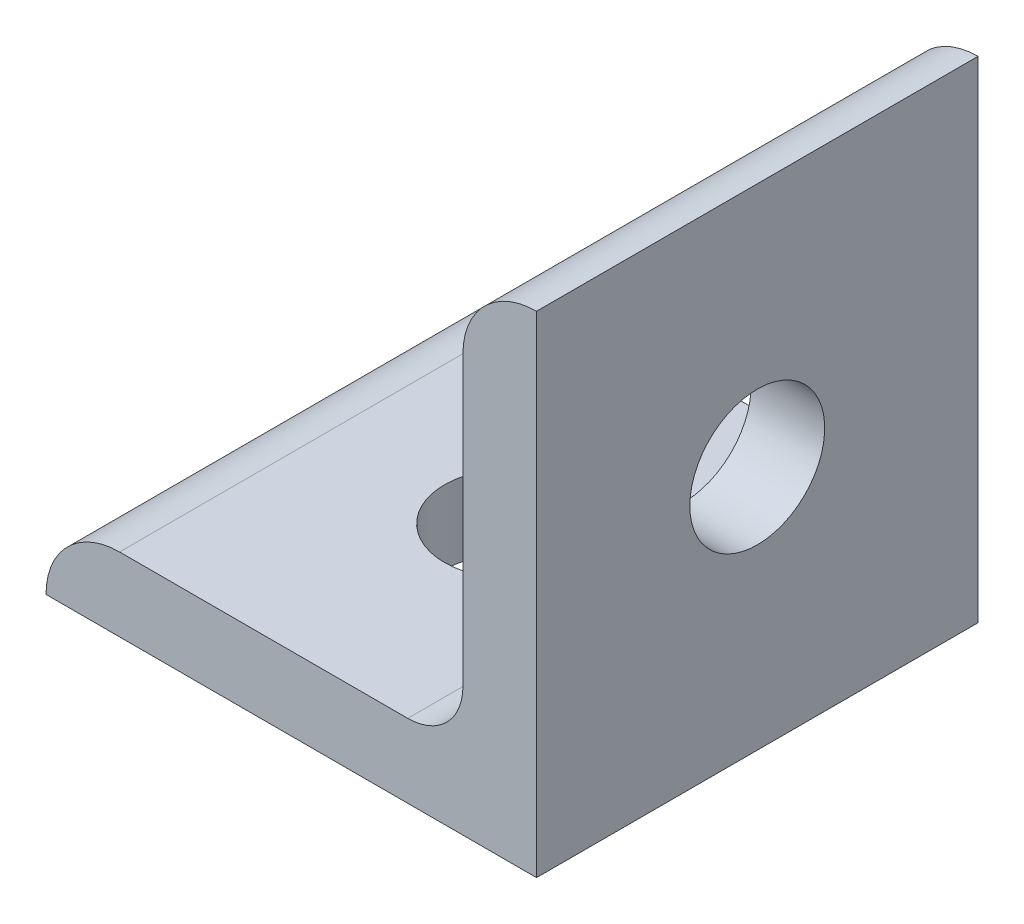
ISO-10303-21;
HEADER;
FILE_DESCRIPTION(('STEP AP214'),'2;1');
FILE_NAME('part.step','',(''),(''),'','','');
FILE_SCHEMA(('AUTOMOTIVE_DESIGN { 1 0 10303 214 1 1 1 1 }'));
ENDSEC;
DATA;
#1=APPLICATION_CONTEXT('core data for automotive mechanical design processes');
#2=APPLICATION_PROTOCOL_DEFINITION('international standard','automotive_design',2000,#1);
#3=PRODUCT_CONTEXT('',#1,'mechanical');
#4=PRODUCT('Part','Part','',(#3));
#5=PRODUCT_RELATED_PRODUCT_CATEGORY('part','',(#4));
#6=PRODUCT_DEFINITION_FORMATION('','',#4);
#7=PRODUCT_DEFINITION_CONTEXT('part definition',#1,'design');
#8=PRODUCT_DEFINITION('design','',#6,#7);
#9=PRODUCT_DEFINITION_SHAPE('','',#8);
#10=(LENGTH_UNIT() NAMED_UNIT(*) SI_UNIT(.MILLI.,.METRE.));
#11=(NAMED_UNIT(*) PLANE_ANGLE_UNIT() SI_UNIT($,.RADIAN.));
#12=(NAMED_UNIT(*) SI_UNIT($,.STERADIAN.) SOLID_ANGLE_UNIT());
#13=UNCERTAINTY_MEASURE_WITH_UNIT(LENGTH_MEASURE(1.E-05),#10,'distance_accuracy_value','');
#14=(GEOMETRIC_REPRESENTATION_CONTEXT(3) GLOBAL_UNCERTAINTY_ASSIGNED_CONTEXT((#13)) GLOBAL_UNIT_ASSIGNED_CONTEXT((#10,
#11,#12)) REPRESENTATION_CONTEXT('',''));
#15=CARTESIAN_POINT('',(0.,0.,0.));
#16=DIRECTION('',(0.,0.,1.));
#17=DIRECTION('',(1.,0.,0.));
#18=AXIS2_PLACEMENT_3D('',#15,#16,#17);
#19=CARTESIAN_POINT('',(0.,0.,-9.));
#20=DIRECTION('',(0.,-1.,0.));
#21=DIRECTION('',(1.,0.,0.));
#22=AXIS2_PLACEMENT_3D('',#19,#20,#21);
#23=PLANE('',#22);
#24=CARTESIAN_POINT('',(-10.,0.,0.));
#25=DIRECTION('',(0.,1.,0.));
#26=DIRECTION('',(0.,0.,1.));
#27=AXIS2_PLACEMENT_3D('',#24,#25,#26);
#28=CIRCLE('',#27,2.75);
#29=CARTESIAN_POINT('',(-10.,0.,2.75));
#30=VERTEX_POINT('',#29);
#31=EDGE_CURVE('E127',#30,#30,#28,.T.);
#32=ORIENTED_EDGE('',*,*,#31,.T.);
#33=EDGE_LOOP('',(#32));
#34=FACE_BOUND('',#33,.T.);
#35=DIRECTION('',(1.,0.,0.));
#36=VECTOR('',#35,1.);
#37=CARTESIAN_POINT('',(0.,0.,9.));
#38=LINE('',#37,#36);
#39=CARTESIAN_POINT('',(-20.,0.,9.));
#40=VERTEX_POINT('',#39);
#41=CARTESIAN_POINT('',(0.,0.,9.));
#42=VERTEX_POINT('',#41);
#43=EDGE_CURVE('E123',#40,#42,#38,.T.);
#44=ORIENTED_EDGE('',*,*,#43,.F.);
#45=DIRECTION('',(0.,0.,1.));
#46=VECTOR('',#45,1.);
#47=CARTESIAN_POINT('',(-20.,0.,-9.));
#48=LINE('',#47,#46);
#49=CARTESIAN_POINT('',(-20.,0.,-9.));
#50=VERTEX_POINT('',#49);
#51=EDGE_CURVE('E11',#50,#40,#48,.T.);
#52=ORIENTED_EDGE('',*,*,#51,.F.);
#53=DIRECTION('',(1.,0.,0.));
#54=VECTOR('',#53,1.);
#55=CARTESIAN_POINT('',(0.,0.,-9.));
#56=LINE('',#55,#54);
#57=CARTESIAN_POINT('',(0.,0.,-9.));
#58=VERTEX_POINT('',#57);
#59=EDGE_CURVE('E141',#50,#58,#56,.T.);
#60=ORIENTED_EDGE('',*,*,#59,.T.);
#61=DIRECTION('',(0.,0.,1.));
#62=VECTOR('',#61,1.);
#63=CARTESIAN_POINT('',(0.,0.,-9.));
#64=LINE('',#63,#62);
#65=EDGE_CURVE('E35',#58,#42,#64,.T.);
#66=ORIENTED_EDGE('',*,*,#65,.T.);
#67=EDGE_LOOP('',(#44,#52,#60,#66));
#68=FACE_BOUND('',#67,.T.);
#69=ADVANCED_FACE('F32',(#34,#68),#23,.T.);
#70=CARTESIAN_POINT('',(-17.,0.,-9.));
#71=DIRECTION('',(0.,0.,1.));
#72=DIRECTION('',(1.,0.,0.));
#73=AXIS2_PLACEMENT_3D('',#70,#71,#72);
#74=CYLINDRICAL_SURFACE('',#73,2.99999999999999);
#75=CARTESIAN_POINT('',(-17.,0.,9.));
#76=DIRECTION('',(0.,0.,1.));
#77=DIRECTION('',(-1.,0.,0.));
#78=AXIS2_PLACEMENT_3D('',#75,#76,#77);
#79=CIRCLE('',#78,2.99999999999999);
#80=CARTESIAN_POINT('',(-17.,3.,9.));
#81=VERTEX_POINT('',#80);
#82=EDGE_CURVE('E139',#81,#40,#79,.T.);
#83=ORIENTED_EDGE('',*,*,#82,.F.);
#84=DIRECTION('',(0.,0.,1.));
#85=VECTOR('',#84,1.);
#86=CARTESIAN_POINT('',(-17.,3.,-9.));
#87=LINE('',#86,#85);
#88=CARTESIAN_POINT('',(-17.,3.,-9.));
#89=VERTEX_POINT('',#88);
#90=EDGE_CURVE('E41',#89,#81,#87,.T.);
#91=ORIENTED_EDGE('',*,*,#90,.F.);
#92=CARTESIAN_POINT('',(-17.,0.,-9.));
#93=DIRECTION('',(0.,0.,1.));
#94=DIRECTION('',(-1.,0.,0.));
#95=AXIS2_PLACEMENT_3D('',#92,#93,#94);
#96=CIRCLE('',#95,2.99999999999999);
#97=EDGE_CURVE('E113',#89,#50,#96,.T.);
#98=ORIENTED_EDGE('',*,*,#97,.T.);
#99=ORIENTED_EDGE('',*,*,#51,.T.);
#100=EDGE_LOOP('',(#83,#91,#98,#99));
#101=FACE_BOUND('',#100,.T.);
#102=ADVANCED_FACE('F151',(#101),#74,.T.);
#103=CARTESIAN_POINT('',(-17.,3.,-9.));
#104=DIRECTION('',(0.,1.,0.));
#105=DIRECTION('',(-1.,0.,0.));
#106=AXIS2_PLACEMENT_3D('',#103,#104,#105);
#107=PLANE('',#106);
#108=CARTESIAN_POINT('',(-10.,3.,0.));
#109=DIRECTION('',(0.,1.,0.));
#110=DIRECTION('',(0.,0.,1.));
#111=AXIS2_PLACEMENT_3D('',#108,#109,#110);
#112=CIRCLE('',#111,2.75);
#113=CARTESIAN_POINT('',(-10.,3.,2.75));
#114=VERTEX_POINT('',#113);
#115=EDGE_CURVE('E182',#114,#114,#112,.T.);
#116=ORIENTED_EDGE('',*,*,#115,.F.);
#117=EDGE_LOOP('',(#116));
#118=FACE_BOUND('',#117,.T.);
#119=DIRECTION('',(-1.,0.,0.));
#120=VECTOR('',#119,1.);
#121=CARTESIAN_POINT('',(-17.,3.,9.));
#122=LINE('',#121,#120);
#123=CARTESIAN_POINT('',(-5.25,3.,9.));
#124=VERTEX_POINT('',#123);
#125=EDGE_CURVE('E100',#124,#81,#122,.T.);
#126=ORIENTED_EDGE('',*,*,#125,.F.);
#127=DIRECTION('',(0.,0.,1.));
#128=VECTOR('',#127,1.);
#129=CARTESIAN_POINT('',(-5.25,3.,-9.));
#130=LINE('',#129,#128);
#131=CARTESIAN_POINT('',(-5.25,3.,-9.));
#132=VERTEX_POINT('',#131);
#133=EDGE_CURVE('E95',#132,#124,#130,.T.);
#134=ORIENTED_EDGE('',*,*,#133,.F.);
#135=DIRECTION('',(-1.,0.,0.));
#136=VECTOR('',#135,1.);
#137=CARTESIAN_POINT('',(-17.,3.,-9.));
#138=LINE('',#137,#136);
#139=EDGE_CURVE('E98',#132,#89,#138,.T.);
#140=ORIENTED_EDGE('',*,*,#139,.T.);
#141=ORIENTED_EDGE('',*,*,#90,.T.);
#142=EDGE_LOOP('',(#126,#134,#140,#141));
#143=FACE_BOUND('',#142,.T.);
#144=ADVANCED_FACE('F97',(#118,#143),#107,.T.);
#145=CARTESIAN_POINT('',(-5.25,5.25,-9.));
#146=DIRECTION('',(0.,0.,1.));
#147=DIRECTION('',(1.,0.,0.));
#148=AXIS2_PLACEMENT_3D('',#145,#146,#147);
#149=CYLINDRICAL_SURFACE('',#148,2.25);
#150=CARTESIAN_POINT('',(-5.25,5.25,9.));
#151=DIRECTION('',(0.,0.,-1.));
#152=DIRECTION('',(1.,0.,0.));
#153=AXIS2_PLACEMENT_3D('',#150,#151,#152);
#154=CIRCLE('',#153,2.25);
#155=CARTESIAN_POINT('',(-3.,5.25,9.));
#156=VERTEX_POINT('',#155);
#157=EDGE_CURVE('E136',#156,#124,#154,.T.);
#158=ORIENTED_EDGE('',*,*,#157,.F.);
#159=DIRECTION('',(0.,0.,1.));
#160=VECTOR('',#159,1.);
#161=CARTESIAN_POINT('',(-3.,5.25,-9.));
#162=LINE('',#161,#160);
#163=CARTESIAN_POINT('',(-3.,5.25,-9.));
#164=VERTEX_POINT('',#163);
#165=EDGE_CURVE('E105',#164,#156,#162,.T.);
#166=ORIENTED_EDGE('',*,*,#165,.F.);
#167=CARTESIAN_POINT('',(-5.25,5.25,-9.));
#168=DIRECTION('',(0.,0.,-1.));
#169=DIRECTION('',(1.,0.,0.));
#170=AXIS2_PLACEMENT_3D('',#167,#168,#169);
#171=CIRCLE('',#170,2.25);
#172=EDGE_CURVE('E111',#164,#132,#171,.T.);
#173=ORIENTED_EDGE('',*,*,#172,.T.);
#174=ORIENTED_EDGE('',*,*,#133,.T.);
#175=EDGE_LOOP('',(#158,#166,#173,#174));
#176=FACE_BOUND('',#175,.T.);
#177=ADVANCED_FACE('F115',(#176),#149,.F.);
#178=CARTESIAN_POINT('',(-3.,5.25,-9.));
#179=DIRECTION('',(-1.,0.,0.));
#180=DIRECTION('',(0.,-1.,0.));
#181=AXIS2_PLACEMENT_3D('',#178,#179,#180);
#182=PLANE('',#181);
#183=CARTESIAN_POINT('',(-3.,10.,0.));
#184=DIRECTION('',(-1.,0.,0.));
#185=DIRECTION('',(0.,0.,1.));
#186=AXIS2_PLACEMENT_3D('',#183,#184,#185);
#187=CIRCLE('',#186,2.75);
#188=CARTESIAN_POINT('',(-3.,10.,2.75));
#189=VERTEX_POINT('',#188);
#190=EDGE_CURVE('E183',#189,#189,#187,.T.);
#191=ORIENTED_EDGE('',*,*,#190,.F.);
#192=EDGE_LOOP('',(#191));
#193=FACE_BOUND('',#192,.T.);
#194=DIRECTION('',(0.,-1.,0.));
#195=VECTOR('',#194,1.);
#196=CARTESIAN_POINT('',(-3.,5.25,9.));
#197=LINE('',#196,#195);
#198=CARTESIAN_POINT('',(-3.,17.,9.));
#199=VERTEX_POINT('',#198);
#200=EDGE_CURVE('E133',#199,#156,#197,.T.);
#201=ORIENTED_EDGE('',*,*,#200,.F.);
#202=DIRECTION('',(0.,0.,1.));
#203=VECTOR('',#202,1.);
#204=CARTESIAN_POINT('',(-3.,17.,-9.));
#205=LINE('',#204,#203);
#206=CARTESIAN_POINT('',(-3.,17.,-9.));
#207=VERTEX_POINT('',#206);
#208=EDGE_CURVE('E145',#207,#199,#205,.T.);
#209=ORIENTED_EDGE('',*,*,#208,.F.);
#210=DIRECTION('',(0.,-1.,0.));
#211=VECTOR('',#210,1.);
#212=CARTESIAN_POINT('',(-3.,5.25,-9.));
#213=LINE('',#212,#211);
#214=EDGE_CURVE('E116',#207,#164,#213,.T.);
#215=ORIENTED_EDGE('',*,*,#214,.T.);
#216=ORIENTED_EDGE('',*,*,#165,.T.);
#217=EDGE_LOOP('',(#201,#209,#215,#216));
#218=FACE_BOUND('',#217,.T.);
#219=ADVANCED_FACE('F166',(#193,#218),#182,.T.);
#220=CARTESIAN_POINT('',(0.,17.,-9.));
#221=DIRECTION('',(0.,0.,1.));
#222=DIRECTION('',(1.,0.,0.));
#223=AXIS2_PLACEMENT_3D('',#220,#221,#222);
#224=CYLINDRICAL_SURFACE('',#223,3.);
#225=CARTESIAN_POINT('',(0.,17.,9.));
#226=DIRECTION('',(0.,0.,1.));
#227=DIRECTION('',(-1.,0.,0.));
#228=AXIS2_PLACEMENT_3D('',#225,#226,#227);
#229=CIRCLE('',#228,3.);
#230=CARTESIAN_POINT('',(0.,20.,9.));
#231=VERTEX_POINT('',#230);
#232=EDGE_CURVE('E130',#231,#199,#229,.T.);
#233=ORIENTED_EDGE('',*,*,#232,.F.);
#234=DIRECTION('',(0.,0.,1.));
#235=VECTOR('',#234,1.);
#236=CARTESIAN_POINT('',(0.,20.,-9.));
#237=LINE('',#236,#235);
#238=CARTESIAN_POINT('',(0.,20.,-9.));
#239=VERTEX_POINT('',#238);
#240=EDGE_CURVE('E146',#239,#231,#237,.T.);
#241=ORIENTED_EDGE('',*,*,#240,.F.);
#242=CARTESIAN_POINT('',(0.,17.,-9.));
#243=DIRECTION('',(0.,0.,1.));
#244=DIRECTION('',(-1.,0.,0.));
#245=AXIS2_PLACEMENT_3D('',#242,#243,#244);
#246=CIRCLE('',#245,3.);
#247=EDGE_CURVE('E118',#239,#207,#246,.T.);
#248=ORIENTED_EDGE('',*,*,#247,.T.);
#249=ORIENTED_EDGE('',*,*,#208,.T.);
#250=EDGE_LOOP('',(#233,#241,#248,#249));
#251=FACE_BOUND('',#250,.T.);
#252=ADVANCED_FACE('F169',(#251),#224,.T.);
#253=CARTESIAN_POINT('',(0.,0.,-9.));
#254=DIRECTION('',(1.,0.,0.));
#255=DIRECTION('',(0.,0.,-1.));
#256=AXIS2_PLACEMENT_3D('',#253,#254,#255);
#257=PLANE('',#256);
#258=CARTESIAN_POINT('',(0.,10.,0.));
#259=DIRECTION('',(-1.,0.,0.));
#260=DIRECTION('',(0.,0.,1.));
#261=AXIS2_PLACEMENT_3D('',#258,#259,#260);
#262=CIRCLE('',#261,2.75);
#263=CARTESIAN_POINT('',(0.,10.,2.75));
#264=VERTEX_POINT('',#263);
#265=EDGE_CURVE('E180',#264,#264,#262,.T.);
#266=ORIENTED_EDGE('',*,*,#265,.T.);
#267=EDGE_LOOP('',(#266));
#268=FACE_BOUND('',#267,.T.);
#269=DIRECTION('',(0.,1.,0.));
#270=VECTOR('',#269,1.);
#271=CARTESIAN_POINT('',(0.,0.,9.));
#272=LINE('',#271,#270);
#273=EDGE_CURVE('E126',#42,#231,#272,.T.);
#274=ORIENTED_EDGE('',*,*,#273,.F.);
#275=ORIENTED_EDGE('',*,*,#65,.F.);
#276=DIRECTION('',(0.,1.,0.));
#277=VECTOR('',#276,1.);
#278=CARTESIAN_POINT('',(0.,0.,-9.));
#279=LINE('',#278,#277);
#280=EDGE_CURVE('E193',#58,#239,#279,.T.);
#281=ORIENTED_EDGE('',*,*,#280,.T.);
#282=ORIENTED_EDGE('',*,*,#240,.T.);
#283=EDGE_LOOP('',(#274,#275,#281,#282));
#284=FACE_BOUND('',#283,.T.);
#285=ADVANCED_FACE('F148',(#268,#284),#257,.T.);
#286=CARTESIAN_POINT('',(-17.,0.,-9.));
#287=DIRECTION('',(0.,0.,-1.));
#288=DIRECTION('',(-1.,0.,0.));
#289=AXIS2_PLACEMENT_3D('',#286,#287,#288);
#290=PLANE('',#289);
#291=ORIENTED_EDGE('',*,*,#59,.F.);
#292=ORIENTED_EDGE('',*,*,#97,.F.);
#293=ORIENTED_EDGE('',*,*,#139,.F.);
#294=ORIENTED_EDGE('',*,*,#172,.F.);
#295=ORIENTED_EDGE('',*,*,#214,.F.);
#296=ORIENTED_EDGE('',*,*,#247,.F.);
#297=ORIENTED_EDGE('',*,*,#280,.F.);
#298=EDGE_LOOP('',(#291,#292,#293,#294,#295,#296,#297));
#299=FACE_BOUND('',#298,.T.);
#300=ADVANCED_FACE('F109',(#299),#290,.T.);
#301=CARTESIAN_POINT('',(-17.,0.,9.));
#302=DIRECTION('',(0.,0.,-1.));
#303=DIRECTION('',(-1.,0.,0.));
#304=AXIS2_PLACEMENT_3D('',#301,#302,#303);
#305=PLANE('',#304);
#306=ORIENTED_EDGE('',*,*,#43,.T.);
#307=ORIENTED_EDGE('',*,*,#273,.T.);
#308=ORIENTED_EDGE('',*,*,#232,.T.);
#309=ORIENTED_EDGE('',*,*,#200,.T.);
#310=ORIENTED_EDGE('',*,*,#157,.T.);
#311=ORIENTED_EDGE('',*,*,#125,.T.);
#312=ORIENTED_EDGE('',*,*,#82,.T.);
#313=EDGE_LOOP('',(#306,#307,#308,#309,#310,#311,#312));
#314=FACE_BOUND('',#313,.T.);
#315=ADVANCED_FACE('F150',(#314),#305,.F.);
#316=CARTESIAN_POINT('',(-10.,0.,0.));
#317=DIRECTION('',(0.,1.,0.));
#318=DIRECTION('',(0.,0.,1.));
#319=AXIS2_PLACEMENT_3D('',#316,#317,#318);
#320=CYLINDRICAL_SURFACE('',#319,2.75);
#321=ORIENTED_EDGE('',*,*,#31,.F.);
#322=EDGE_LOOP('',(#321));
#323=FACE_BOUND('',#322,.T.);
#324=ORIENTED_EDGE('',*,*,#115,.T.);
#325=EDGE_LOOP('',(#324));
#326=FACE_BOUND('',#325,.T.);
#327=ADVANCED_FACE('F200',(#323,#326),#320,.F.);
#328=CARTESIAN_POINT('',(0.,10.,0.));
#329=DIRECTION('',(-1.,0.,0.));
#330=DIRECTION('',(0.,0.,1.));
#331=AXIS2_PLACEMENT_3D('',#328,#329,#330);
#332=CYLINDRICAL_SURFACE('',#331,2.75);
#333=ORIENTED_EDGE('',*,*,#265,.F.);
#334=EDGE_LOOP('',(#333));
#335=FACE_BOUND('',#334,.T.);
#336=ORIENTED_EDGE('',*,*,#190,.T.);
#337=EDGE_LOOP('',(#336));
#338=FACE_BOUND('',#337,.T.);
#339=ADVANCED_FACE('F203',(#335,#338),#332,.F.);
#340=CLOSED_SHELL('',(#69,#102,#144,#177,#219,#252,#285,#300,#315,#327,#339));
#341=MANIFOLD_SOLID_BREP('B2',#340);
#342=ADVANCED_BREP_SHAPE_REPRESENTATION('',(#18,#341),#14);
#343=SHAPE_DEFINITION_REPRESENTATION(#9,#342);
ENDSEC;
END-ISO-10303-21;
